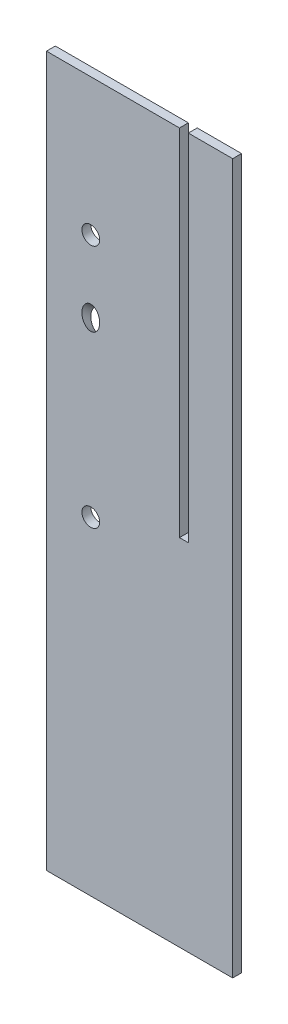
ISO-10303-21;
HEADER;
FILE_DESCRIPTION(('STEP AP214'),'2;1');
FILE_NAME('part.step','',(''),(''),'','','');
FILE_SCHEMA(('AUTOMOTIVE_DESIGN { 1 0 10303 214 1 1 1 1 }'));
ENDSEC;
DATA;
#1=APPLICATION_CONTEXT('core data for automotive mechanical design processes');
#2=APPLICATION_PROTOCOL_DEFINITION('international standard','automotive_design',2000,#1);
#3=PRODUCT_CONTEXT('',#1,'mechanical');
#4=PRODUCT('Part','Part','',(#3));
#5=PRODUCT_RELATED_PRODUCT_CATEGORY('part','',(#4));
#6=PRODUCT_DEFINITION_FORMATION('','',#4);
#7=PRODUCT_DEFINITION_CONTEXT('part definition',#1,'design');
#8=PRODUCT_DEFINITION('design','',#6,#7);
#9=PRODUCT_DEFINITION_SHAPE('','',#8);
#10=(LENGTH_UNIT() NAMED_UNIT(*) SI_UNIT(.MILLI.,.METRE.));
#11=(NAMED_UNIT(*) PLANE_ANGLE_UNIT() SI_UNIT($,.RADIAN.));
#12=(NAMED_UNIT(*) SI_UNIT($,.STERADIAN.) SOLID_ANGLE_UNIT());
#13=UNCERTAINTY_MEASURE_WITH_UNIT(LENGTH_MEASURE(1.E-05),#10,'distance_accuracy_value','');
#14=(GEOMETRIC_REPRESENTATION_CONTEXT(3) GLOBAL_UNCERTAINTY_ASSIGNED_CONTEXT((#13)) GLOBAL_UNIT_ASSIGNED_CONTEXT((#10,
#11,#12)) REPRESENTATION_CONTEXT('',''));
#15=CARTESIAN_POINT('',(0.,0.,0.));
#16=DIRECTION('',(0.,0.,1.));
#17=DIRECTION('',(1.,0.,0.));
#18=AXIS2_PLACEMENT_3D('',#15,#16,#17);
#19=CARTESIAN_POINT('',(-133.35,1016.,6.35));
#20=DIRECTION('',(0.,-1.,0.));
#21=DIRECTION('',(0.,0.,-1.));
#22=AXIS2_PLACEMENT_3D('',#19,#20,#21);
#23=PLANE('',#22);
#24=DIRECTION('',(-1.,0.,0.));
#25=VECTOR('',#24,1.);
#26=CARTESIAN_POINT('',(-133.35,1016.,-6.35));
#27=LINE('',#26,#25);
#28=CARTESIAN_POINT('',(133.35,1016.,-6.35));
#29=VERTEX_POINT('',#28);
#30=CARTESIAN_POINT('',(69.85,1016.,-6.35));
#31=VERTEX_POINT('',#30);
#32=EDGE_CURVE('E112',#29,#31,#27,.T.);
#33=ORIENTED_EDGE('',*,*,#32,.T.);
#34=DIRECTION('',(0.,0.,1.));
#35=VECTOR('',#34,1.);
#36=CARTESIAN_POINT('',(69.85,1016.,-6.35));
#37=LINE('',#36,#35);
#38=CARTESIAN_POINT('',(69.85,1016.,6.35));
#39=VERTEX_POINT('',#38);
#40=EDGE_CURVE('E182',#31,#39,#37,.T.);
#41=ORIENTED_EDGE('',*,*,#40,.T.);
#42=DIRECTION('',(-1.,0.,0.));
#43=VECTOR('',#42,1.);
#44=CARTESIAN_POINT('',(-133.35,1016.,6.35));
#45=LINE('',#44,#43);
#46=CARTESIAN_POINT('',(133.35,1016.,6.35));
#47=VERTEX_POINT('',#46);
#48=EDGE_CURVE('E131',#47,#39,#45,.T.);
#49=ORIENTED_EDGE('',*,*,#48,.F.);
#50=DIRECTION('',(0.,0.,-1.));
#51=VECTOR('',#50,1.);
#52=CARTESIAN_POINT('',(133.35,1016.,6.35));
#53=LINE('',#52,#51);
#54=EDGE_CURVE('E139',#47,#29,#53,.T.);
#55=ORIENTED_EDGE('',*,*,#54,.T.);
#56=EDGE_LOOP('',(#33,#41,#49,#55));
#57=FACE_BOUND('',#56,.T.);
#58=ADVANCED_FACE('F37',(#57),#23,.F.);
#59=CARTESIAN_POINT('',(-133.35,0.,6.35));
#60=DIRECTION('',(1.,0.,0.));
#61=DIRECTION('',(0.,1.,0.));
#62=AXIS2_PLACEMENT_3D('',#59,#60,#61);
#63=PLANE('',#62);
#64=DIRECTION('',(0.,-1.,0.));
#65=VECTOR('',#64,1.);
#66=CARTESIAN_POINT('',(-133.35,0.,-6.35));
#67=LINE('',#66,#65);
#68=CARTESIAN_POINT('',(-133.35,1016.,-6.35));
#69=VERTEX_POINT('',#68);
#70=CARTESIAN_POINT('',(-133.35,0.,-6.35));
#71=VERTEX_POINT('',#70);
#72=EDGE_CURVE('E119',#69,#71,#67,.T.);
#73=ORIENTED_EDGE('',*,*,#72,.T.);
#74=DIRECTION('',(0.,0.,-1.));
#75=VECTOR('',#74,1.);
#76=CARTESIAN_POINT('',(-133.35,0.,6.35));
#77=LINE('',#76,#75);
#78=CARTESIAN_POINT('',(-133.35,0.,6.35));
#79=VERTEX_POINT('',#78);
#80=EDGE_CURVE('E156',#79,#71,#77,.T.);
#81=ORIENTED_EDGE('',*,*,#80,.F.);
#82=DIRECTION('',(0.,-1.,0.));
#83=VECTOR('',#82,1.);
#84=CARTESIAN_POINT('',(-133.35,0.,6.35));
#85=LINE('',#84,#83);
#86=CARTESIAN_POINT('',(-133.35,1016.,6.35));
#87=VERTEX_POINT('',#86);
#88=EDGE_CURVE('E120',#87,#79,#85,.T.);
#89=ORIENTED_EDGE('',*,*,#88,.F.);
#90=DIRECTION('',(0.,0.,-1.));
#91=VECTOR('',#90,1.);
#92=CARTESIAN_POINT('',(-133.35,1016.,6.35));
#93=LINE('',#92,#91);
#94=EDGE_CURVE('E107',#87,#69,#93,.T.);
#95=ORIENTED_EDGE('',*,*,#94,.T.);
#96=EDGE_LOOP('',(#73,#81,#89,#95));
#97=FACE_BOUND('',#96,.T.);
#98=ADVANCED_FACE('F117',(#97),#63,.F.);
#99=CARTESIAN_POINT('',(-133.35,0.,6.35));
#100=DIRECTION('',(0.,1.,0.));
#101=DIRECTION('',(-1.,0.,0.));
#102=AXIS2_PLACEMENT_3D('',#99,#100,#101);
#103=PLANE('',#102);
#104=DIRECTION('',(1.,0.,0.));
#105=VECTOR('',#104,1.);
#106=CARTESIAN_POINT('',(-133.35,0.,-6.35));
#107=LINE('',#106,#105);
#108=CARTESIAN_POINT('',(133.35,0.,-6.35));
#109=VERTEX_POINT('',#108);
#110=EDGE_CURVE('E63',#71,#109,#107,.T.);
#111=ORIENTED_EDGE('',*,*,#110,.T.);
#112=DIRECTION('',(0.,0.,-1.));
#113=VECTOR('',#112,1.);
#114=CARTESIAN_POINT('',(133.35,0.,6.35));
#115=LINE('',#114,#113);
#116=CARTESIAN_POINT('',(133.35,0.,6.35));
#117=VERTEX_POINT('',#116);
#118=EDGE_CURVE('E113',#117,#109,#115,.T.);
#119=ORIENTED_EDGE('',*,*,#118,.F.);
#120=DIRECTION('',(1.,0.,0.));
#121=VECTOR('',#120,1.);
#122=CARTESIAN_POINT('',(-133.35,0.,6.35));
#123=LINE('',#122,#121);
#124=EDGE_CURVE('E82',#79,#117,#123,.T.);
#125=ORIENTED_EDGE('',*,*,#124,.F.);
#126=ORIENTED_EDGE('',*,*,#80,.T.);
#127=EDGE_LOOP('',(#111,#119,#125,#126));
#128=FACE_BOUND('',#127,.T.);
#129=ADVANCED_FACE('F231',(#128),#103,.F.);
#130=CARTESIAN_POINT('',(133.35,0.,6.35));
#131=DIRECTION('',(-1.,0.,0.));
#132=DIRECTION('',(0.,0.,1.));
#133=AXIS2_PLACEMENT_3D('',#130,#131,#132);
#134=PLANE('',#133);
#135=DIRECTION('',(0.,1.,0.));
#136=VECTOR('',#135,1.);
#137=CARTESIAN_POINT('',(133.35,0.,-6.35));
#138=LINE('',#137,#136);
#139=EDGE_CURVE('E158',#109,#29,#138,.T.);
#140=ORIENTED_EDGE('',*,*,#139,.T.);
#141=ORIENTED_EDGE('',*,*,#54,.F.);
#142=DIRECTION('',(0.,1.,0.));
#143=VECTOR('',#142,1.);
#144=CARTESIAN_POINT('',(133.35,0.,6.35));
#145=LINE('',#144,#143);
#146=EDGE_CURVE('E136',#117,#47,#145,.T.);
#147=ORIENTED_EDGE('',*,*,#146,.F.);
#148=ORIENTED_EDGE('',*,*,#118,.T.);
#149=EDGE_LOOP('',(#140,#141,#147,#148));
#150=FACE_BOUND('',#149,.T.);
#151=ADVANCED_FACE('F164',(#150),#134,.F.);
#152=CARTESIAN_POINT('',(57.15,1016.,6.35));
#153=VERTEX_POINT('',#152);
#154=EDGE_CURVE('E135',#153,#87,#45,.T.);
#155=ORIENTED_EDGE('',*,*,#154,.F.);
#156=DIRECTION('',(0.,0.,1.));
#157=VECTOR('',#156,1.);
#158=CARTESIAN_POINT('',(57.15,1016.,-6.35));
#159=LINE('',#158,#157);
#160=CARTESIAN_POINT('',(57.15,1016.,-6.35));
#161=VERTEX_POINT('',#160);
#162=EDGE_CURVE('E110',#161,#153,#159,.T.);
#163=ORIENTED_EDGE('',*,*,#162,.F.);
#164=EDGE_CURVE('E103',#161,#69,#27,.T.);
#165=ORIENTED_EDGE('',*,*,#164,.T.);
#166=ORIENTED_EDGE('',*,*,#94,.F.);
#167=EDGE_LOOP('',(#155,#163,#165,#166));
#168=FACE_BOUND('',#167,.T.);
#169=ADVANCED_FACE('F106',(#168),#23,.F.);
#170=CARTESIAN_POINT('',(0.,0.,6.35));
#171=DIRECTION('',(0.,0.,-1.));
#172=DIRECTION('',(-1.,0.,0.));
#173=AXIS2_PLACEMENT_3D('',#170,#171,#172);
#174=PLANE('',#173);
#175=CARTESIAN_POINT('',(-69.8499999999999,469.899999999998,6.34999999999999));
#176=DIRECTION('',(0.,0.,-1.));
#177=DIRECTION('',(-1.,0.,0.));
#178=AXIS2_PLACEMENT_3D('',#175,#176,#177);
#179=CIRCLE('',#178,12.7);
#180=CARTESIAN_POINT('',(-82.5499999999999,469.899999999998,6.34999999999999));
#181=VERTEX_POINT('',#180);
#182=EDGE_CURVE('E11',#181,#181,#179,.F.);
#183=ORIENTED_EDGE('',*,*,#182,.F.);
#184=EDGE_LOOP('',(#183));
#185=FACE_BOUND('',#184,.T.);
#186=CARTESIAN_POINT('',(-69.85,717.131250000006,6.34999999999999));
#187=DIRECTION('',(0.,0.,-1.));
#188=DIRECTION('',(0.,-1.,0.));
#189=AXIS2_PLACEMENT_3D('',#186,#187,#188);
#190=ELLIPSE('',#189,16.8753564777163,12.7);
#191=CARTESIAN_POINT('',(-69.85,700.255893522289,6.34999999999999));
#192=VERTEX_POINT('',#191);
#193=EDGE_CURVE('E46',#192,#192,#190,.F.);
#194=ORIENTED_EDGE('',*,*,#193,.F.);
#195=EDGE_LOOP('',(#194));
#196=FACE_BOUND('',#195,.T.);
#197=CARTESIAN_POINT('',(-69.85,819.899999999998,6.34999999999999));
#198=DIRECTION('',(0.,0.,-1.));
#199=DIRECTION('',(-1.,0.,0.));
#200=AXIS2_PLACEMENT_3D('',#197,#198,#199);
#201=CIRCLE('',#200,12.7);
#202=CARTESIAN_POINT('',(-82.55,819.899999999998,6.34999999999999));
#203=VERTEX_POINT('',#202);
#204=EDGE_CURVE('E41',#203,#203,#201,.F.);
#205=ORIENTED_EDGE('',*,*,#204,.F.);
#206=EDGE_LOOP('',(#205));
#207=FACE_BOUND('',#206,.T.);
#208=ORIENTED_EDGE('',*,*,#48,.T.);
#209=DIRECTION('',(0.,1.,0.));
#210=VECTOR('',#209,1.);
#211=CARTESIAN_POINT('',(69.85,1016.,6.35));
#212=LINE('',#211,#210);
#213=CARTESIAN_POINT('',(69.8500000000001,508.,6.35));
#214=VERTEX_POINT('',#213);
#215=EDGE_CURVE('E206',#214,#39,#212,.T.);
#216=ORIENTED_EDGE('',*,*,#215,.F.);
#217=DIRECTION('',(1.,0.,0.));
#218=VECTOR('',#217,1.);
#219=CARTESIAN_POINT('',(69.8500000000001,508.,6.35));
#220=LINE('',#219,#218);
#221=CARTESIAN_POINT('',(57.15,508.,6.35));
#222=VERTEX_POINT('',#221);
#223=EDGE_CURVE('E175',#222,#214,#220,.T.);
#224=ORIENTED_EDGE('',*,*,#223,.F.);
#225=DIRECTION('',(0.,-1.,0.));
#226=VECTOR('',#225,1.);
#227=CARTESIAN_POINT('',(57.15,1016.,6.35));
#228=LINE('',#227,#226);
#229=EDGE_CURVE('E178',#153,#222,#228,.T.);
#230=ORIENTED_EDGE('',*,*,#229,.F.);
#231=ORIENTED_EDGE('',*,*,#154,.T.);
#232=ORIENTED_EDGE('',*,*,#88,.T.);
#233=ORIENTED_EDGE('',*,*,#124,.T.);
#234=ORIENTED_EDGE('',*,*,#146,.T.);
#235=EDGE_LOOP('',(#208,#216,#224,#230,#231,#232,#233,#234));
#236=FACE_BOUND('',#235,.T.);
#237=ADVANCED_FACE('F39',(#185,#196,#207,#236),#174,.F.);
#238=CARTESIAN_POINT('',(0.,0.,-6.35));
#239=DIRECTION('',(0.,0.,-1.));
#240=DIRECTION('',(-1.,0.,0.));
#241=AXIS2_PLACEMENT_3D('',#238,#239,#240);
#242=PLANE('',#241);
#243=DIRECTION('',(0.,1.,0.));
#244=VECTOR('',#243,1.);
#245=CARTESIAN_POINT('',(69.85,1016.,-6.35));
#246=LINE('',#245,#244);
#247=CARTESIAN_POINT('',(69.8500000000001,508.,-6.35));
#248=VERTEX_POINT('',#247);
#249=EDGE_CURVE('E170',#248,#31,#246,.T.);
#250=ORIENTED_EDGE('',*,*,#249,.T.);
#251=ORIENTED_EDGE('',*,*,#32,.F.);
#252=ORIENTED_EDGE('',*,*,#139,.F.);
#253=ORIENTED_EDGE('',*,*,#110,.F.);
#254=ORIENTED_EDGE('',*,*,#72,.F.);
#255=ORIENTED_EDGE('',*,*,#164,.F.);
#256=DIRECTION('',(0.,-1.,0.));
#257=VECTOR('',#256,1.);
#258=CARTESIAN_POINT('',(57.15,1016.,-6.35));
#259=LINE('',#258,#257);
#260=CARTESIAN_POINT('',(57.15,508.,-6.35));
#261=VERTEX_POINT('',#260);
#262=EDGE_CURVE('E174',#161,#261,#259,.T.);
#263=ORIENTED_EDGE('',*,*,#262,.T.);
#264=DIRECTION('',(1.,0.,0.));
#265=VECTOR('',#264,1.);
#266=CARTESIAN_POINT('',(69.8500000000001,508.,-6.35));
#267=LINE('',#266,#265);
#268=EDGE_CURVE('E54',#261,#248,#267,.T.);
#269=ORIENTED_EDGE('',*,*,#268,.T.);
#270=EDGE_LOOP('',(#250,#251,#252,#253,#254,#255,#263,#269));
#271=FACE_BOUND('',#270,.T.);
#272=CARTESIAN_POINT('',(-69.8499999999999,469.899999999998,-6.34999999999999));
#273=DIRECTION('',(0.,0.,-1.));
#274=DIRECTION('',(-1.,0.,0.));
#275=AXIS2_PLACEMENT_3D('',#272,#273,#274);
#276=CIRCLE('',#275,12.7);
#277=CARTESIAN_POINT('',(-82.5499999999999,469.899999999998,-6.34999999999999));
#278=VERTEX_POINT('',#277);
#279=EDGE_CURVE('E134',#278,#278,#276,.F.);
#280=ORIENTED_EDGE('',*,*,#279,.T.);
#281=EDGE_LOOP('',(#280));
#282=FACE_BOUND('',#281,.T.);
#283=CARTESIAN_POINT('',(-69.85,706.018750000006,-6.34999999999999));
#284=DIRECTION('',(0.,0.,-1.));
#285=DIRECTION('',(0.,-1.,0.));
#286=AXIS2_PLACEMENT_3D('',#283,#284,#285);
#287=ELLIPSE('',#286,16.8753564777163,12.7);
#288=CARTESIAN_POINT('',(-69.85,689.143393522289,-6.34999999999999));
#289=VERTEX_POINT('',#288);
#290=EDGE_CURVE('E148',#289,#289,#287,.F.);
#291=ORIENTED_EDGE('',*,*,#290,.T.);
#292=EDGE_LOOP('',(#291));
#293=FACE_BOUND('',#292,.T.);
#294=CARTESIAN_POINT('',(-69.85,819.899999999998,-6.34999999999999));
#295=DIRECTION('',(0.,0.,-1.));
#296=DIRECTION('',(-1.,0.,0.));
#297=AXIS2_PLACEMENT_3D('',#294,#295,#296);
#298=CIRCLE('',#297,12.7);
#299=CARTESIAN_POINT('',(-82.55,819.899999999998,-6.34999999999999));
#300=VERTEX_POINT('',#299);
#301=EDGE_CURVE('E144',#300,#300,#298,.F.);
#302=ORIENTED_EDGE('',*,*,#301,.T.);
#303=EDGE_LOOP('',(#302));
#304=FACE_BOUND('',#303,.T.);
#305=ADVANCED_FACE('F123',(#271,#282,#293,#304),#242,.T.);
#306=CARTESIAN_POINT('',(-69.8499999999999,819.899999999998,123.799999999991));
#307=DIRECTION('',(0.,0.,-1.));
#308=DIRECTION('',(-1.,0.,0.));
#309=AXIS2_PLACEMENT_3D('',#306,#307,#308);
#310=CYLINDRICAL_SURFACE('',#309,12.7);
#311=ORIENTED_EDGE('',*,*,#301,.F.);
#312=EDGE_LOOP('',(#311));
#313=FACE_BOUND('',#312,.T.);
#314=ORIENTED_EDGE('',*,*,#204,.T.);
#315=EDGE_LOOP('',(#314));
#316=FACE_BOUND('',#315,.T.);
#317=ADVANCED_FACE('F284',(#313,#316),#310,.F.);
#318=CARTESIAN_POINT('',(-69.8499999999999,819.899999999998,123.799999999991));
#319=DIRECTION('',(0.,-0.658504607868519,-0.752576694706877));
#320=DIRECTION('',(0.,0.752576694706877,-0.658504607868519));
#321=AXIS2_PLACEMENT_3D('',#318,#319,#320);
#322=CYLINDRICAL_SURFACE('',#321,12.7);
#323=ORIENTED_EDGE('',*,*,#290,.F.);
#324=EDGE_LOOP('',(#323));
#325=FACE_BOUND('',#324,.T.);
#326=ORIENTED_EDGE('',*,*,#193,.T.);
#327=EDGE_LOOP('',(#326));
#328=FACE_BOUND('',#327,.T.);
#329=ADVANCED_FACE('F194',(#325,#328),#322,.F.);
#330=CARTESIAN_POINT('',(-69.8499999999999,469.899999999998,123.799999999994));
#331=DIRECTION('',(0.,0.,-1.));
#332=DIRECTION('',(-1.,0.,0.));
#333=AXIS2_PLACEMENT_3D('',#330,#331,#332);
#334=CYLINDRICAL_SURFACE('',#333,12.7);
#335=ORIENTED_EDGE('',*,*,#279,.F.);
#336=EDGE_LOOP('',(#335));
#337=FACE_BOUND('',#336,.T.);
#338=ORIENTED_EDGE('',*,*,#182,.T.);
#339=EDGE_LOOP('',(#338));
#340=FACE_BOUND('',#339,.T.);
#341=ADVANCED_FACE('F190',(#337,#340),#334,.F.);
#342=CARTESIAN_POINT('',(69.85,1016.,-6.35));
#343=DIRECTION('',(1.,0.,0.));
#344=DIRECTION('',(0.,1.,0.));
#345=AXIS2_PLACEMENT_3D('',#342,#343,#344);
#346=PLANE('',#345);
#347=ORIENTED_EDGE('',*,*,#40,.F.);
#348=ORIENTED_EDGE('',*,*,#249,.F.);
#349=DIRECTION('',(0.,0.,1.));
#350=VECTOR('',#349,1.);
#351=CARTESIAN_POINT('',(69.8500000000001,508.,-6.35));
#352=LINE('',#351,#350);
#353=EDGE_CURVE('E91',#248,#214,#352,.T.);
#354=ORIENTED_EDGE('',*,*,#353,.T.);
#355=ORIENTED_EDGE('',*,*,#215,.T.);
#356=EDGE_LOOP('',(#347,#348,#354,#355));
#357=FACE_BOUND('',#356,.T.);
#358=ADVANCED_FACE('F193',(#357),#346,.F.);
#359=CARTESIAN_POINT('',(69.8500000000001,508.,-6.35));
#360=DIRECTION('',(0.,-1.,0.));
#361=DIRECTION('',(0.,0.,-1.));
#362=AXIS2_PLACEMENT_3D('',#359,#360,#361);
#363=PLANE('',#362);
#364=ORIENTED_EDGE('',*,*,#353,.F.);
#365=ORIENTED_EDGE('',*,*,#268,.F.);
#366=DIRECTION('',(0.,0.,1.));
#367=VECTOR('',#366,1.);
#368=CARTESIAN_POINT('',(57.15,508.,-6.35));
#369=LINE('',#368,#367);
#370=EDGE_CURVE('E126',#261,#222,#369,.T.);
#371=ORIENTED_EDGE('',*,*,#370,.T.);
#372=ORIENTED_EDGE('',*,*,#223,.T.);
#373=EDGE_LOOP('',(#364,#365,#371,#372));
#374=FACE_BOUND('',#373,.T.);
#375=ADVANCED_FACE('F213',(#374),#363,.F.);
#376=CARTESIAN_POINT('',(57.15,1016.,-6.35));
#377=DIRECTION('',(-1.,0.,0.));
#378=DIRECTION('',(0.,-1.,0.));
#379=AXIS2_PLACEMENT_3D('',#376,#377,#378);
#380=PLANE('',#379);
#381=ORIENTED_EDGE('',*,*,#370,.F.);
#382=ORIENTED_EDGE('',*,*,#262,.F.);
#383=ORIENTED_EDGE('',*,*,#162,.T.);
#384=ORIENTED_EDGE('',*,*,#229,.T.);
#385=EDGE_LOOP('',(#381,#382,#383,#384));
#386=FACE_BOUND('',#385,.T.);
#387=ADVANCED_FACE('F218',(#386),#380,.F.);
#388=CLOSED_SHELL('',(#58,#98,#129,#151,#169,#237,#305,#317,#329,#341,#358,#375,#387));
#389=MANIFOLD_SOLID_BREP('B2',#388);
#390=ADVANCED_BREP_SHAPE_REPRESENTATION('',(#18,#389),#14);
#391=SHAPE_DEFINITION_REPRESENTATION(#9,#390);
ENDSEC;
END-ISO-10303-21;
